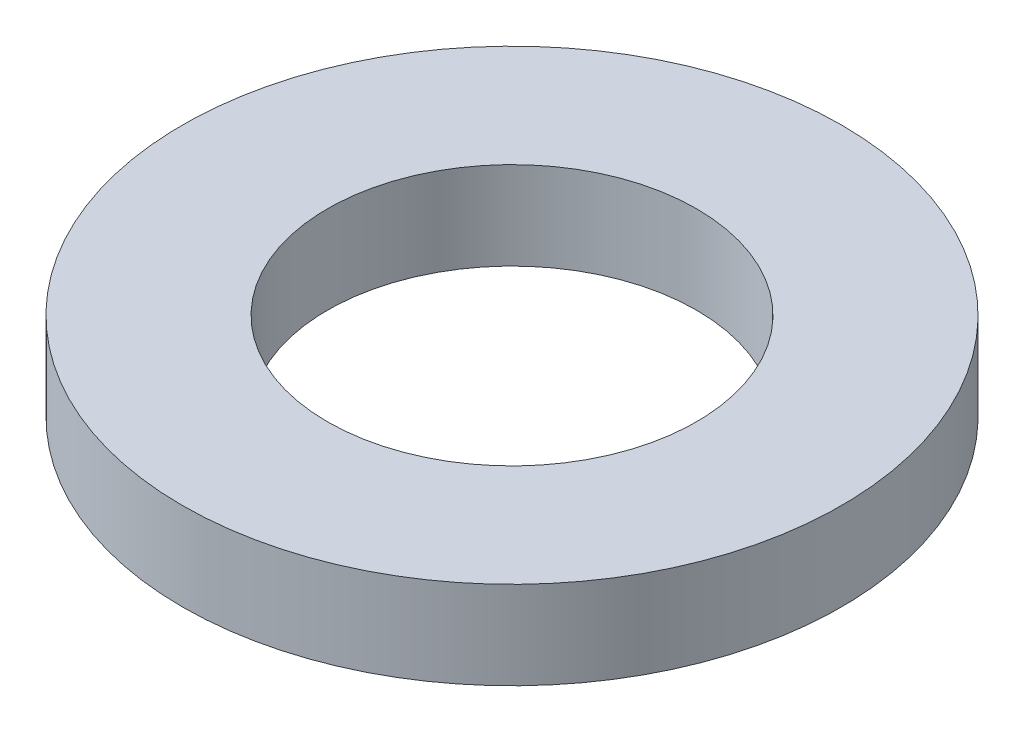
ISO-10303-21;
HEADER;
FILE_DESCRIPTION(('STEP AP214'),'2;1');
FILE_NAME('part.step','',(''),(''),'','','');
FILE_SCHEMA(('AUTOMOTIVE_DESIGN { 1 0 10303 214 1 1 1 1 }'));
ENDSEC;
DATA;
#1=APPLICATION_CONTEXT('core data for automotive mechanical design processes');
#2=APPLICATION_PROTOCOL_DEFINITION('international standard','automotive_design',2000,#1);
#3=PRODUCT_CONTEXT('',#1,'mechanical');
#4=PRODUCT('Part','Part','',(#3));
#5=PRODUCT_RELATED_PRODUCT_CATEGORY('part','',(#4));
#6=PRODUCT_DEFINITION_FORMATION('','',#4);
#7=PRODUCT_DEFINITION_CONTEXT('part definition',#1,'design');
#8=PRODUCT_DEFINITION('design','',#6,#7);
#9=PRODUCT_DEFINITION_SHAPE('','',#8);
#10=(LENGTH_UNIT() NAMED_UNIT(*) SI_UNIT(.MILLI.,.METRE.));
#11=(NAMED_UNIT(*) PLANE_ANGLE_UNIT() SI_UNIT($,.RADIAN.));
#12=(NAMED_UNIT(*) SI_UNIT($,.STERADIAN.) SOLID_ANGLE_UNIT());
#13=UNCERTAINTY_MEASURE_WITH_UNIT(LENGTH_MEASURE(1.E-05),#10,'distance_accuracy_value','');
#14=(GEOMETRIC_REPRESENTATION_CONTEXT(3) GLOBAL_UNCERTAINTY_ASSIGNED_CONTEXT((#13)) GLOBAL_UNIT_ASSIGNED_CONTEXT((#10,
#11,#12)) REPRESENTATION_CONTEXT('',''));
#15=CARTESIAN_POINT('',(0.,0.,0.));
#16=DIRECTION('',(0.,0.,1.));
#17=DIRECTION('',(1.,0.,0.));
#18=AXIS2_PLACEMENT_3D('',#15,#16,#17);
#19=CARTESIAN_POINT('',(0.,2.,0.));
#20=DIRECTION('',(0.,1.,0.));
#21=DIRECTION('',(0.,0.,1.));
#22=AXIS2_PLACEMENT_3D('',#19,#20,#21);
#23=PLANE('',#22);
#24=CARTESIAN_POINT('',(0.,2.,0.));
#25=DIRECTION('',(0.,1.,0.));
#26=DIRECTION('',(0.,0.,1.));
#27=AXIS2_PLACEMENT_3D('',#24,#25,#26);
#28=CIRCLE('',#27,7.5);
#29=CARTESIAN_POINT('',(0.,2.,7.5));
#30=VERTEX_POINT('',#29);
#31=EDGE_CURVE('E10',#30,#30,#28,.T.);
#32=ORIENTED_EDGE('',*,*,#31,.T.);
#33=EDGE_LOOP('',(#32));
#34=FACE_BOUND('',#33,.T.);
#35=CARTESIAN_POINT('',(0.,2.,0.));
#36=DIRECTION('',(0.,1.,0.));
#37=DIRECTION('',(0.,0.,1.));
#38=AXIS2_PLACEMENT_3D('',#35,#36,#37);
#39=CIRCLE('',#38,4.2);
#40=CARTESIAN_POINT('',(0.,2.,4.2));
#41=VERTEX_POINT('',#40);
#42=EDGE_CURVE('E41',#41,#41,#39,.T.);
#43=ORIENTED_EDGE('',*,*,#42,.F.);
#44=EDGE_LOOP('',(#43));
#45=FACE_BOUND('',#44,.T.);
#46=ADVANCED_FACE('F30',(#34,#45),#23,.T.);
#47=CARTESIAN_POINT('',(0.,0.,0.));
#48=DIRECTION('',(0.,1.,0.));
#49=DIRECTION('',(0.,0.,1.));
#50=AXIS2_PLACEMENT_3D('',#47,#48,#49);
#51=PLANE('',#50);
#52=CARTESIAN_POINT('',(0.,0.,0.));
#53=DIRECTION('',(0.,1.,0.));
#54=DIRECTION('',(0.,0.,1.));
#55=AXIS2_PLACEMENT_3D('',#52,#53,#54);
#56=CIRCLE('',#55,7.5);
#57=CARTESIAN_POINT('',(0.,0.,7.5));
#58=VERTEX_POINT('',#57);
#59=EDGE_CURVE('E34',#58,#58,#56,.T.);
#60=ORIENTED_EDGE('',*,*,#59,.F.);
#61=EDGE_LOOP('',(#60));
#62=FACE_BOUND('',#61,.T.);
#63=CARTESIAN_POINT('',(0.,0.,0.));
#64=DIRECTION('',(0.,1.,0.));
#65=DIRECTION('',(0.,0.,1.));
#66=AXIS2_PLACEMENT_3D('',#63,#64,#65);
#67=CIRCLE('',#66,4.2);
#68=CARTESIAN_POINT('',(0.,0.,4.2));
#69=VERTEX_POINT('',#68);
#70=EDGE_CURVE('E43',#69,#69,#67,.T.);
#71=ORIENTED_EDGE('',*,*,#70,.T.);
#72=EDGE_LOOP('',(#71));
#73=FACE_BOUND('',#72,.T.);
#74=ADVANCED_FACE('F53',(#62,#73),#51,.F.);
#75=CARTESIAN_POINT('',(0.,2.,0.));
#76=DIRECTION('',(0.,-1.,0.));
#77=DIRECTION('',(0.,0.,-1.));
#78=AXIS2_PLACEMENT_3D('',#75,#76,#77);
#79=CYLINDRICAL_SURFACE('',#78,7.5);
#80=ORIENTED_EDGE('',*,*,#31,.F.);
#81=EDGE_LOOP('',(#80));
#82=FACE_BOUND('',#81,.T.);
#83=ORIENTED_EDGE('',*,*,#59,.T.);
#84=EDGE_LOOP('',(#83));
#85=FACE_BOUND('',#84,.T.);
#86=ADVANCED_FACE('F32',(#82,#85),#79,.T.);
#87=CARTESIAN_POINT('',(0.,2.,0.));
#88=DIRECTION('',(0.,-1.,0.));
#89=DIRECTION('',(0.,0.,-1.));
#90=AXIS2_PLACEMENT_3D('',#87,#88,#89);
#91=CYLINDRICAL_SURFACE('',#90,4.2);
#92=ORIENTED_EDGE('',*,*,#42,.T.);
#93=EDGE_LOOP('',(#92));
#94=FACE_BOUND('',#93,.T.);
#95=ORIENTED_EDGE('',*,*,#70,.F.);
#96=EDGE_LOOP('',(#95));
#97=FACE_BOUND('',#96,.T.);
#98=ADVANCED_FACE('F49',(#94,#97),#91,.F.);
#99=CLOSED_SHELL('',(#46,#74,#86,#98));
#100=MANIFOLD_SOLID_BREP('B2',#99);
#101=ADVANCED_BREP_SHAPE_REPRESENTATION('',(#18,#100),#14);
#102=SHAPE_DEFINITION_REPRESENTATION(#9,#101);
ENDSEC;
END-ISO-10303-21;
